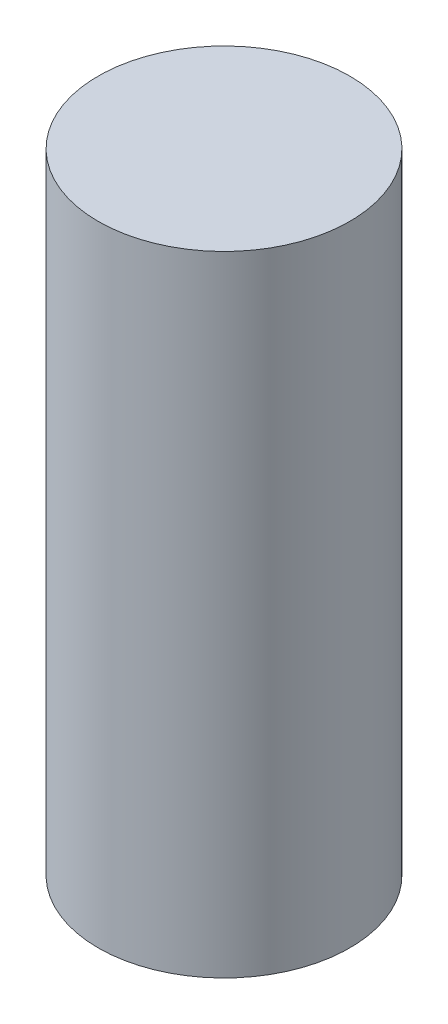
ISO-10303-21;
HEADER;
FILE_DESCRIPTION(('STEP AP214'),'2;1');
FILE_NAME('part.step','',(''),(''),'','','');
FILE_SCHEMA(('AUTOMOTIVE_DESIGN { 1 0 10303 214 1 1 1 1 }'));
ENDSEC;
DATA;
#1=APPLICATION_CONTEXT('core data for automotive mechanical design processes');
#2=APPLICATION_PROTOCOL_DEFINITION('international standard','automotive_design',2000,#1);
#3=PRODUCT_CONTEXT('',#1,'mechanical');
#4=PRODUCT('Part','Part','',(#3));
#5=PRODUCT_RELATED_PRODUCT_CATEGORY('part','',(#4));
#6=PRODUCT_DEFINITION_FORMATION('','',#4);
#7=PRODUCT_DEFINITION_CONTEXT('part definition',#1,'design');
#8=PRODUCT_DEFINITION('design','',#6,#7);
#9=PRODUCT_DEFINITION_SHAPE('','',#8);
#10=(LENGTH_UNIT() NAMED_UNIT(*) SI_UNIT(.MILLI.,.METRE.));
#11=(NAMED_UNIT(*) PLANE_ANGLE_UNIT() SI_UNIT($,.RADIAN.));
#12=(NAMED_UNIT(*) SI_UNIT($,.STERADIAN.) SOLID_ANGLE_UNIT());
#13=UNCERTAINTY_MEASURE_WITH_UNIT(LENGTH_MEASURE(1.E-05),#10,'distance_accuracy_value','');
#14=(GEOMETRIC_REPRESENTATION_CONTEXT(3) GLOBAL_UNCERTAINTY_ASSIGNED_CONTEXT((#13)) GLOBAL_UNIT_ASSIGNED_CONTEXT((#10,
#11,#12)) REPRESENTATION_CONTEXT('',''));
#15=CARTESIAN_POINT('',(0.,0.,0.));
#16=DIRECTION('',(0.,0.,1.));
#17=DIRECTION('',(1.,0.,0.));
#18=AXIS2_PLACEMENT_3D('',#15,#16,#17);
#19=CARTESIAN_POINT('',(0.,15.875,0.));
#20=DIRECTION('',(0.,-1.,0.));
#21=DIRECTION('',(0.,0.,-1.));
#22=AXIS2_PLACEMENT_3D('',#19,#20,#21);
#23=CYLINDRICAL_SURFACE('',#22,3.175);
#24=CARTESIAN_POINT('',(0.,15.875,0.));
#25=DIRECTION('',(0.,1.,0.));
#26=DIRECTION('',(0.,0.,1.));
#27=AXIS2_PLACEMENT_3D('',#24,#25,#26);
#28=CIRCLE('',#27,3.175);
#29=CARTESIAN_POINT('',(0.,15.875,3.175));
#30=VERTEX_POINT('',#29);
#31=EDGE_CURVE('E10',#30,#30,#28,.T.);
#32=ORIENTED_EDGE('',*,*,#31,.F.);
#33=EDGE_LOOP('',(#32));
#34=FACE_BOUND('',#33,.T.);
#35=CARTESIAN_POINT('',(0.,0.,0.));
#36=DIRECTION('',(0.,1.,0.));
#37=DIRECTION('',(0.,0.,1.));
#38=AXIS2_PLACEMENT_3D('',#35,#36,#37);
#39=CIRCLE('',#38,3.175);
#40=CARTESIAN_POINT('',(0.,0.,3.175));
#41=VERTEX_POINT('',#40);
#42=EDGE_CURVE('E38',#41,#41,#39,.T.);
#43=ORIENTED_EDGE('',*,*,#42,.T.);
#44=EDGE_LOOP('',(#43));
#45=FACE_BOUND('',#44,.T.);
#46=ADVANCED_FACE('F35',(#34,#45),#23,.T.);
#47=CARTESIAN_POINT('',(0.,15.875,0.));
#48=DIRECTION('',(0.,1.,0.));
#49=DIRECTION('',(0.,0.,1.));
#50=AXIS2_PLACEMENT_3D('',#47,#48,#49);
#51=PLANE('',#50);
#52=ORIENTED_EDGE('',*,*,#31,.T.);
#53=EDGE_LOOP('',(#52));
#54=FACE_BOUND('',#53,.T.);
#55=ADVANCED_FACE('F52',(#54),#51,.T.);
#56=CARTESIAN_POINT('',(0.,0.,0.));
#57=DIRECTION('',(0.,1.,0.));
#58=DIRECTION('',(0.,0.,1.));
#59=AXIS2_PLACEMENT_3D('',#56,#57,#58);
#60=PLANE('',#59);
#61=ORIENTED_EDGE('',*,*,#42,.F.);
#62=EDGE_LOOP('',(#61));
#63=FACE_BOUND('',#62,.T.);
#64=ADVANCED_FACE('F50',(#63),#60,.F.);
#65=CLOSED_SHELL('',(#46,#55,#64));
#66=MANIFOLD_SOLID_BREP('B2',#65);
#67=ADVANCED_BREP_SHAPE_REPRESENTATION('',(#18,#66),#14);
#68=SHAPE_DEFINITION_REPRESENTATION(#9,#67);
ENDSEC;
END-ISO-10303-21;
